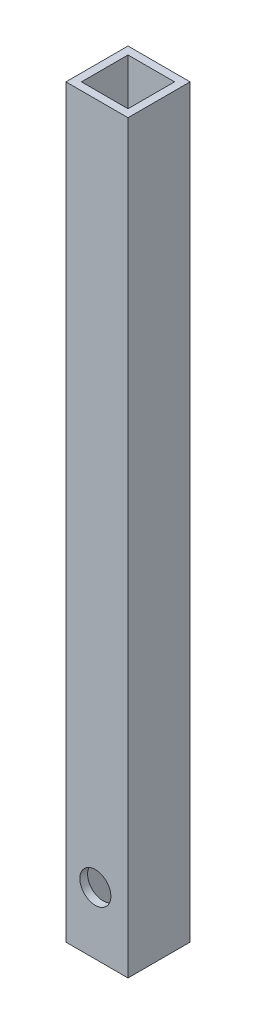
ISO-10303-21;
HEADER;
FILE_DESCRIPTION(('STEP AP214'),'2;1');
FILE_NAME('part.step','',(''),(''),'','','');
FILE_SCHEMA(('AUTOMOTIVE_DESIGN { 1 0 10303 214 1 1 1 1 }'));
ENDSEC;
DATA;
#1=APPLICATION_CONTEXT('core data for automotive mechanical design processes');
#2=APPLICATION_PROTOCOL_DEFINITION('international standard','automotive_design',2000,#1);
#3=PRODUCT_CONTEXT('',#1,'mechanical');
#4=PRODUCT('Part','Part','',(#3));
#5=PRODUCT_RELATED_PRODUCT_CATEGORY('part','',(#4));
#6=PRODUCT_DEFINITION_FORMATION('','',#4);
#7=PRODUCT_DEFINITION_CONTEXT('part definition',#1,'design');
#8=PRODUCT_DEFINITION('design','',#6,#7);
#9=PRODUCT_DEFINITION_SHAPE('','',#8);
#10=(LENGTH_UNIT() NAMED_UNIT(*) SI_UNIT(.MILLI.,.METRE.));
#11=(NAMED_UNIT(*) PLANE_ANGLE_UNIT() SI_UNIT($,.RADIAN.));
#12=(NAMED_UNIT(*) SI_UNIT($,.STERADIAN.) SOLID_ANGLE_UNIT());
#13=UNCERTAINTY_MEASURE_WITH_UNIT(LENGTH_MEASURE(1.E-05),#10,'distance_accuracy_value','');
#14=(GEOMETRIC_REPRESENTATION_CONTEXT(3) GLOBAL_UNCERTAINTY_ASSIGNED_CONTEXT((#13)) GLOBAL_UNIT_ASSIGNED_CONTEXT((#10,
#11,#12)) REPRESENTATION_CONTEXT('',''));
#15=CARTESIAN_POINT('',(0.,0.,0.));
#16=DIRECTION('',(0.,0.,1.));
#17=DIRECTION('',(1.,0.,0.));
#18=AXIS2_PLACEMENT_3D('',#15,#16,#17);
#19=CARTESIAN_POINT('',(0.,152.4,0.));
#20=DIRECTION('',(0.,-1.,0.));
#21=DIRECTION('',(0.,0.,-1.));
#22=AXIS2_PLACEMENT_3D('',#19,#20,#21);
#23=PLANE('',#22);
#24=DIRECTION('',(0.,0.,1.));
#25=VECTOR('',#24,1.);
#26=CARTESIAN_POINT('',(0.,152.4,0.));
#27=LINE('',#26,#25);
#28=CARTESIAN_POINT('',(0.,152.4,-12.7));
#29=VERTEX_POINT('',#28);
#30=CARTESIAN_POINT('',(0.,152.4,0.));
#31=VERTEX_POINT('',#30);
#32=EDGE_CURVE('E155',#29,#31,#27,.T.);
#33=ORIENTED_EDGE('',*,*,#32,.T.);
#34=DIRECTION('',(1.,0.,0.));
#35=VECTOR('',#34,1.);
#36=CARTESIAN_POINT('',(0.,152.4,0.));
#37=LINE('',#36,#35);
#38=CARTESIAN_POINT('',(12.7,152.4,0.));
#39=VERTEX_POINT('',#38);
#40=EDGE_CURVE('E158',#31,#39,#37,.T.);
#41=ORIENTED_EDGE('',*,*,#40,.T.);
#42=DIRECTION('',(0.,0.,-1.));
#43=VECTOR('',#42,1.);
#44=CARTESIAN_POINT('',(12.7,152.4,0.));
#45=LINE('',#44,#43);
#46=CARTESIAN_POINT('',(12.7,152.4,-12.7));
#47=VERTEX_POINT('',#46);
#48=EDGE_CURVE('E161',#39,#47,#45,.T.);
#49=ORIENTED_EDGE('',*,*,#48,.T.);
#50=DIRECTION('',(-1.,0.,0.));
#51=VECTOR('',#50,1.);
#52=CARTESIAN_POINT('',(0.,152.4,-12.7));
#53=LINE('',#52,#51);
#54=EDGE_CURVE('E163',#47,#29,#53,.T.);
#55=ORIENTED_EDGE('',*,*,#54,.T.);
#56=EDGE_LOOP('',(#33,#41,#49,#55));
#57=FACE_BOUND('',#56,.T.);
#58=DIRECTION('',(0.,0.,1.));
#59=VECTOR('',#58,1.);
#60=CARTESIAN_POINT('',(1.5875,152.4,-1.5875));
#61=LINE('',#60,#59);
#62=CARTESIAN_POINT('',(1.5875,152.4,-11.1125));
#63=VERTEX_POINT('',#62);
#64=CARTESIAN_POINT('',(1.5875,152.4,-1.5875));
#65=VERTEX_POINT('',#64);
#66=EDGE_CURVE('E110',#63,#65,#61,.T.);
#67=ORIENTED_EDGE('',*,*,#66,.F.);
#68=DIRECTION('',(-1.,0.,0.));
#69=VECTOR('',#68,1.);
#70=CARTESIAN_POINT('',(1.5875,152.4,-11.1125));
#71=LINE('',#70,#69);
#72=CARTESIAN_POINT('',(11.1125,152.4,-11.1125));
#73=VERTEX_POINT('',#72);
#74=EDGE_CURVE('E133',#73,#63,#71,.T.);
#75=ORIENTED_EDGE('',*,*,#74,.F.);
#76=DIRECTION('',(0.,0.,-1.));
#77=VECTOR('',#76,1.);
#78=CARTESIAN_POINT('',(11.1125,152.4,-1.5875));
#79=LINE('',#78,#77);
#80=CARTESIAN_POINT('',(11.1125,152.4,-1.5875));
#81=VERTEX_POINT('',#80);
#82=EDGE_CURVE('E131',#81,#73,#79,.T.);
#83=ORIENTED_EDGE('',*,*,#82,.F.);
#84=DIRECTION('',(1.,0.,0.));
#85=VECTOR('',#84,1.);
#86=CARTESIAN_POINT('',(1.5875,152.4,-1.5875));
#87=LINE('',#86,#85);
#88=EDGE_CURVE('E118',#65,#81,#87,.T.);
#89=ORIENTED_EDGE('',*,*,#88,.F.);
#90=EDGE_LOOP('',(#67,#75,#83,#89));
#91=FACE_BOUND('',#90,.T.);
#92=ADVANCED_FACE('F39',(#57,#91),#23,.F.);
#93=CARTESIAN_POINT('',(0.,0.,0.));
#94=DIRECTION('',(0.,-1.,0.));
#95=DIRECTION('',(0.,0.,-1.));
#96=AXIS2_PLACEMENT_3D('',#93,#94,#95);
#97=PLANE('',#96);
#98=DIRECTION('',(0.,0.,1.));
#99=VECTOR('',#98,1.);
#100=CARTESIAN_POINT('',(0.,0.,0.));
#101=LINE('',#100,#99);
#102=CARTESIAN_POINT('',(0.,0.,-12.7));
#103=VERTEX_POINT('',#102);
#104=CARTESIAN_POINT('',(0.,0.,0.));
#105=VERTEX_POINT('',#104);
#106=EDGE_CURVE('E127',#103,#105,#101,.T.);
#107=ORIENTED_EDGE('',*,*,#106,.F.);
#108=DIRECTION('',(-1.,0.,0.));
#109=VECTOR('',#108,1.);
#110=CARTESIAN_POINT('',(0.,0.,-12.7));
#111=LINE('',#110,#109);
#112=CARTESIAN_POINT('',(12.7,0.,-12.7));
#113=VERTEX_POINT('',#112);
#114=EDGE_CURVE('E159',#113,#103,#111,.T.);
#115=ORIENTED_EDGE('',*,*,#114,.F.);
#116=DIRECTION('',(0.,0.,-1.));
#117=VECTOR('',#116,1.);
#118=CARTESIAN_POINT('',(12.7,0.,0.));
#119=LINE('',#118,#117);
#120=CARTESIAN_POINT('',(12.7,0.,0.));
#121=VERTEX_POINT('',#120);
#122=EDGE_CURVE('E171',#121,#113,#119,.T.);
#123=ORIENTED_EDGE('',*,*,#122,.F.);
#124=DIRECTION('',(1.,0.,0.));
#125=VECTOR('',#124,1.);
#126=CARTESIAN_POINT('',(0.,0.,0.));
#127=LINE('',#126,#125);
#128=EDGE_CURVE('E169',#105,#121,#127,.T.);
#129=ORIENTED_EDGE('',*,*,#128,.F.);
#130=EDGE_LOOP('',(#107,#115,#123,#129));
#131=FACE_BOUND('',#130,.T.);
#132=DIRECTION('',(-1.,0.,0.));
#133=VECTOR('',#132,1.);
#134=CARTESIAN_POINT('',(1.5875,0.,-11.1125));
#135=LINE('',#134,#133);
#136=CARTESIAN_POINT('',(11.1125,0.,-11.1125));
#137=VERTEX_POINT('',#136);
#138=CARTESIAN_POINT('',(1.5875,0.,-11.1125));
#139=VERTEX_POINT('',#138);
#140=EDGE_CURVE('E119',#137,#139,#135,.T.);
#141=ORIENTED_EDGE('',*,*,#140,.T.);
#142=DIRECTION('',(0.,0.,1.));
#143=VECTOR('',#142,1.);
#144=CARTESIAN_POINT('',(1.5875,0.,-1.5875));
#145=LINE('',#144,#143);
#146=CARTESIAN_POINT('',(1.5875,0.,-1.5875));
#147=VERTEX_POINT('',#146);
#148=EDGE_CURVE('E66',#139,#147,#145,.T.);
#149=ORIENTED_EDGE('',*,*,#148,.T.);
#150=DIRECTION('',(1.,0.,0.));
#151=VECTOR('',#150,1.);
#152=CARTESIAN_POINT('',(1.5875,0.,-1.5875));
#153=LINE('',#152,#151);
#154=CARTESIAN_POINT('',(11.1125,0.,-1.5875));
#155=VERTEX_POINT('',#154);
#156=EDGE_CURVE('E125',#147,#155,#153,.T.);
#157=ORIENTED_EDGE('',*,*,#156,.T.);
#158=DIRECTION('',(0.,0.,-1.));
#159=VECTOR('',#158,1.);
#160=CARTESIAN_POINT('',(11.1125,0.,-1.5875));
#161=LINE('',#160,#159);
#162=EDGE_CURVE('E142',#155,#137,#161,.T.);
#163=ORIENTED_EDGE('',*,*,#162,.T.);
#164=EDGE_LOOP('',(#141,#149,#157,#163));
#165=FACE_BOUND('',#164,.T.);
#166=ADVANCED_FACE('F195',(#131,#165),#97,.T.);
#167=CARTESIAN_POINT('',(0.,152.4,0.));
#168=DIRECTION('',(1.,0.,0.));
#169=DIRECTION('',(0.,0.,-1.));
#170=AXIS2_PLACEMENT_3D('',#167,#168,#169);
#171=PLANE('',#170);
#172=ORIENTED_EDGE('',*,*,#106,.T.);
#173=DIRECTION('',(0.,-1.,0.));
#174=VECTOR('',#173,1.);
#175=CARTESIAN_POINT('',(0.,152.4,0.));
#176=LINE('',#175,#174);
#177=EDGE_CURVE('E11',#31,#105,#176,.T.);
#178=ORIENTED_EDGE('',*,*,#177,.F.);
#179=ORIENTED_EDGE('',*,*,#32,.F.);
#180=DIRECTION('',(0.,-1.,0.));
#181=VECTOR('',#180,1.);
#182=CARTESIAN_POINT('',(0.,152.4,-12.7));
#183=LINE('',#182,#181);
#184=EDGE_CURVE('E165',#29,#103,#183,.T.);
#185=ORIENTED_EDGE('',*,*,#184,.T.);
#186=EDGE_LOOP('',(#172,#178,#179,#185));
#187=FACE_BOUND('',#186,.T.);
#188=ADVANCED_FACE('F41',(#187),#171,.F.);
#189=CARTESIAN_POINT('',(0.,152.4,0.));
#190=DIRECTION('',(0.,0.,-1.));
#191=DIRECTION('',(-1.,0.,0.));
#192=AXIS2_PLACEMENT_3D('',#189,#190,#191);
#193=PLANE('',#192);
#194=CARTESIAN_POINT('',(6.02233999999993,12.7000000000001,0.));
#195=DIRECTION('',(0.,0.,-1.));
#196=DIRECTION('',(-1.,0.,0.));
#197=AXIS2_PLACEMENT_3D('',#194,#195,#196);
#198=CIRCLE('',#197,3.175);
#199=CARTESIAN_POINT('',(2.84733999999993,12.7000000000001,0.));
#200=VERTEX_POINT('',#199);
#201=EDGE_CURVE('E235',#200,#200,#198,.T.);
#202=ORIENTED_EDGE('',*,*,#201,.T.);
#203=EDGE_LOOP('',(#202));
#204=FACE_BOUND('',#203,.T.);
#205=ORIENTED_EDGE('',*,*,#128,.T.);
#206=DIRECTION('',(0.,-1.,0.));
#207=VECTOR('',#206,1.);
#208=CARTESIAN_POINT('',(12.7,152.4,0.));
#209=LINE('',#208,#207);
#210=EDGE_CURVE('E49',#39,#121,#209,.T.);
#211=ORIENTED_EDGE('',*,*,#210,.F.);
#212=ORIENTED_EDGE('',*,*,#40,.F.);
#213=ORIENTED_EDGE('',*,*,#177,.T.);
#214=EDGE_LOOP('',(#205,#211,#212,#213));
#215=FACE_BOUND('',#214,.T.);
#216=ADVANCED_FACE('F205',(#204,#215),#193,.F.);
#217=CARTESIAN_POINT('',(12.7,152.4,0.));
#218=DIRECTION('',(-1.,0.,0.));
#219=DIRECTION('',(0.,0.,1.));
#220=AXIS2_PLACEMENT_3D('',#217,#218,#219);
#221=PLANE('',#220);
#222=ORIENTED_EDGE('',*,*,#122,.T.);
#223=DIRECTION('',(0.,-1.,0.));
#224=VECTOR('',#223,1.);
#225=CARTESIAN_POINT('',(12.7,152.4,-12.7));
#226=LINE('',#225,#224);
#227=EDGE_CURVE('E179',#47,#113,#226,.T.);
#228=ORIENTED_EDGE('',*,*,#227,.F.);
#229=ORIENTED_EDGE('',*,*,#48,.F.);
#230=ORIENTED_EDGE('',*,*,#210,.T.);
#231=EDGE_LOOP('',(#222,#228,#229,#230));
#232=FACE_BOUND('',#231,.T.);
#233=ADVANCED_FACE('F189',(#232),#221,.F.);
#234=CARTESIAN_POINT('',(0.,152.4,-12.7));
#235=DIRECTION('',(0.,0.,1.));
#236=DIRECTION('',(1.,0.,0.));
#237=AXIS2_PLACEMENT_3D('',#234,#235,#236);
#238=PLANE('',#237);
#239=CARTESIAN_POINT('',(6.02233999999993,12.7000000000001,-12.7));
#240=DIRECTION('',(0.,0.,-1.));
#241=DIRECTION('',(-1.,0.,0.));
#242=AXIS2_PLACEMENT_3D('',#239,#240,#241);
#243=CIRCLE('',#242,3.175);
#244=CARTESIAN_POINT('',(2.84733999999993,12.7000000000001,-12.7));
#245=VERTEX_POINT('',#244);
#246=EDGE_CURVE('E232',#245,#245,#243,.T.);
#247=ORIENTED_EDGE('',*,*,#246,.F.);
#248=EDGE_LOOP('',(#247));
#249=FACE_BOUND('',#248,.T.);
#250=ORIENTED_EDGE('',*,*,#114,.T.);
#251=ORIENTED_EDGE('',*,*,#184,.F.);
#252=ORIENTED_EDGE('',*,*,#54,.F.);
#253=ORIENTED_EDGE('',*,*,#227,.T.);
#254=EDGE_LOOP('',(#250,#251,#252,#253));
#255=FACE_BOUND('',#254,.T.);
#256=ADVANCED_FACE('F199',(#249,#255),#238,.F.);
#257=CARTESIAN_POINT('',(1.5875,152.4,-1.5875));
#258=DIRECTION('',(1.,0.,0.));
#259=DIRECTION('',(0.,0.,-1.));
#260=AXIS2_PLACEMENT_3D('',#257,#258,#259);
#261=PLANE('',#260);
#262=ORIENTED_EDGE('',*,*,#148,.F.);
#263=DIRECTION('',(0.,-1.,0.));
#264=VECTOR('',#263,1.);
#265=CARTESIAN_POINT('',(1.5875,152.4,-11.1125));
#266=LINE('',#265,#264);
#267=EDGE_CURVE('E114',#63,#139,#266,.T.);
#268=ORIENTED_EDGE('',*,*,#267,.F.);
#269=ORIENTED_EDGE('',*,*,#66,.T.);
#270=DIRECTION('',(0.,-1.,0.));
#271=VECTOR('',#270,1.);
#272=CARTESIAN_POINT('',(1.5875,152.4,-1.5875));
#273=LINE('',#272,#271);
#274=EDGE_CURVE('E113',#65,#147,#273,.T.);
#275=ORIENTED_EDGE('',*,*,#274,.T.);
#276=EDGE_LOOP('',(#262,#268,#269,#275));
#277=FACE_BOUND('',#276,.T.);
#278=ADVANCED_FACE('F112',(#277),#261,.T.);
#279=CARTESIAN_POINT('',(1.5875,152.4,-1.5875));
#280=DIRECTION('',(0.,0.,-1.));
#281=DIRECTION('',(-1.,0.,0.));
#282=AXIS2_PLACEMENT_3D('',#279,#280,#281);
#283=PLANE('',#282);
#284=CARTESIAN_POINT('',(6.02233999999993,12.7000000000001,-1.5875));
#285=DIRECTION('',(0.,0.,-1.));
#286=DIRECTION('',(-1.,0.,0.));
#287=AXIS2_PLACEMENT_3D('',#284,#285,#286);
#288=CIRCLE('',#287,3.175);
#289=CARTESIAN_POINT('',(2.84733999999993,12.7000000000001,-1.5875));
#290=VERTEX_POINT('',#289);
#291=EDGE_CURVE('E140',#290,#290,#288,.T.);
#292=ORIENTED_EDGE('',*,*,#291,.F.);
#293=EDGE_LOOP('',(#292));
#294=FACE_BOUND('',#293,.T.);
#295=ORIENTED_EDGE('',*,*,#156,.F.);
#296=ORIENTED_EDGE('',*,*,#274,.F.);
#297=ORIENTED_EDGE('',*,*,#88,.T.);
#298=DIRECTION('',(0.,-1.,0.));
#299=VECTOR('',#298,1.);
#300=CARTESIAN_POINT('',(11.1125,152.4,-1.5875));
#301=LINE('',#300,#299);
#302=EDGE_CURVE('E128',#81,#155,#301,.T.);
#303=ORIENTED_EDGE('',*,*,#302,.T.);
#304=EDGE_LOOP('',(#295,#296,#297,#303));
#305=FACE_BOUND('',#304,.T.);
#306=ADVANCED_FACE('F122',(#294,#305),#283,.T.);
#307=CARTESIAN_POINT('',(11.1125,152.4,-1.5875));
#308=DIRECTION('',(-1.,0.,0.));
#309=DIRECTION('',(0.,0.,1.));
#310=AXIS2_PLACEMENT_3D('',#307,#308,#309);
#311=PLANE('',#310);
#312=ORIENTED_EDGE('',*,*,#162,.F.);
#313=ORIENTED_EDGE('',*,*,#302,.F.);
#314=ORIENTED_EDGE('',*,*,#82,.T.);
#315=DIRECTION('',(0.,-1.,0.));
#316=VECTOR('',#315,1.);
#317=CARTESIAN_POINT('',(11.1125,152.4,-11.1125));
#318=LINE('',#317,#316);
#319=EDGE_CURVE('E56',#73,#137,#318,.T.);
#320=ORIENTED_EDGE('',*,*,#319,.T.);
#321=EDGE_LOOP('',(#312,#313,#314,#320));
#322=FACE_BOUND('',#321,.T.);
#323=ADVANCED_FACE('F251',(#322),#311,.T.);
#324=CARTESIAN_POINT('',(1.5875,152.4,-11.1125));
#325=DIRECTION('',(0.,0.,1.));
#326=DIRECTION('',(1.,0.,0.));
#327=AXIS2_PLACEMENT_3D('',#324,#325,#326);
#328=PLANE('',#327);
#329=CARTESIAN_POINT('',(6.02233999999993,12.7000000000001,-11.1125));
#330=DIRECTION('',(0.,0.,1.));
#331=DIRECTION('',(1.,0.,0.));
#332=AXIS2_PLACEMENT_3D('',#329,#330,#331);
#333=CIRCLE('',#332,3.175);
#334=CARTESIAN_POINT('',(9.19733999999993,12.7000000000001,-11.1125));
#335=VERTEX_POINT('',#334);
#336=EDGE_CURVE('E43',#335,#335,#333,.T.);
#337=ORIENTED_EDGE('',*,*,#336,.F.);
#338=EDGE_LOOP('',(#337));
#339=FACE_BOUND('',#338,.T.);
#340=ORIENTED_EDGE('',*,*,#140,.F.);
#341=ORIENTED_EDGE('',*,*,#319,.F.);
#342=ORIENTED_EDGE('',*,*,#74,.T.);
#343=ORIENTED_EDGE('',*,*,#267,.T.);
#344=EDGE_LOOP('',(#340,#341,#342,#343));
#345=FACE_BOUND('',#344,.T.);
#346=ADVANCED_FACE('F249',(#339,#345),#328,.T.);
#347=CARTESIAN_POINT('',(6.02233999999993,12.7000000000001,0.));
#348=DIRECTION('',(0.,0.,-1.));
#349=DIRECTION('',(-1.,0.,0.));
#350=AXIS2_PLACEMENT_3D('',#347,#348,#349);
#351=CYLINDRICAL_SURFACE('',#350,3.175);
#352=ORIENTED_EDGE('',*,*,#336,.T.);
#353=EDGE_LOOP('',(#352));
#354=FACE_BOUND('',#353,.T.);
#355=ORIENTED_EDGE('',*,*,#246,.T.);
#356=EDGE_LOOP('',(#355));
#357=FACE_BOUND('',#356,.T.);
#358=ADVANCED_FACE('F247',(#354,#357),#351,.F.);
#359=ORIENTED_EDGE('',*,*,#291,.T.);
#360=EDGE_LOOP('',(#359));
#361=FACE_BOUND('',#360,.T.);
#362=ORIENTED_EDGE('',*,*,#201,.F.);
#363=EDGE_LOOP('',(#362));
#364=FACE_BOUND('',#363,.T.);
#365=ADVANCED_FACE('F263',(#361,#364),#351,.F.);
#366=CLOSED_SHELL('',(#92,#166,#188,#216,#233,#256,#278,#306,#323,#346,#358,#365));
#367=MANIFOLD_SOLID_BREP('B2',#366);
#368=ADVANCED_BREP_SHAPE_REPRESENTATION('',(#18,#367),#14);
#369=SHAPE_DEFINITION_REPRESENTATION(#9,#368);
ENDSEC;
END-ISO-10303-21;
